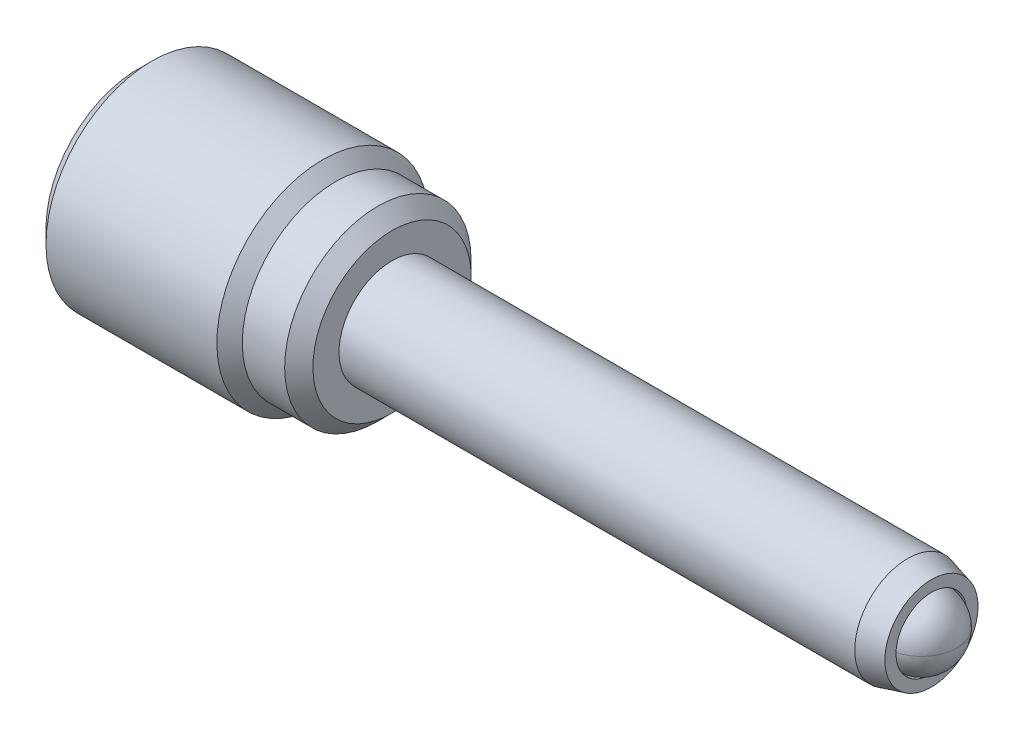
ISO-10303-21;
HEADER;
FILE_DESCRIPTION(('STEP AP214'),'2;1');
FILE_NAME('part.step','',(''),(''),'','','');
FILE_SCHEMA(('AUTOMOTIVE_DESIGN { 1 0 10303 214 1 1 1 1 }'));
ENDSEC;
DATA;
#1=APPLICATION_CONTEXT('core data for automotive mechanical design processes');
#2=APPLICATION_PROTOCOL_DEFINITION('international standard','automotive_design',2000,#1);
#3=PRODUCT_CONTEXT('',#1,'mechanical');
#4=PRODUCT('Part','Part','',(#3));
#5=PRODUCT_RELATED_PRODUCT_CATEGORY('part','',(#4));
#6=PRODUCT_DEFINITION_FORMATION('','',#4);
#7=PRODUCT_DEFINITION_CONTEXT('part definition',#1,'design');
#8=PRODUCT_DEFINITION('design','',#6,#7);
#9=PRODUCT_DEFINITION_SHAPE('','',#8);
#10=(LENGTH_UNIT() NAMED_UNIT(*) SI_UNIT(.MILLI.,.METRE.));
#11=(NAMED_UNIT(*) PLANE_ANGLE_UNIT() SI_UNIT($,.RADIAN.));
#12=(NAMED_UNIT(*) SI_UNIT($,.STERADIAN.) SOLID_ANGLE_UNIT());
#13=UNCERTAINTY_MEASURE_WITH_UNIT(LENGTH_MEASURE(1.E-05),#10,'distance_accuracy_value','');
#14=(GEOMETRIC_REPRESENTATION_CONTEXT(3) GLOBAL_UNCERTAINTY_ASSIGNED_CONTEXT((#13)) GLOBAL_UNIT_ASSIGNED_CONTEXT((#10,
#11,#12)) REPRESENTATION_CONTEXT('',''));
#15=CARTESIAN_POINT('',(0.,0.,0.));
#16=DIRECTION('',(0.,0.,1.));
#17=DIRECTION('',(1.,0.,0.));
#18=AXIS2_PLACEMENT_3D('',#15,#16,#17);
#19=CARTESIAN_POINT('',(-20.193,0.,0.));
#20=DIRECTION('',(-1.,0.,0.));
#21=DIRECTION('',(0.,-1.,0.));
#22=AXIS2_PLACEMENT_3D('',#19,#20,#21);
#23=PLANE('',#22);
#24=CARTESIAN_POINT('',(-20.193,0.,0.));
#25=DIRECTION('',(-1.,0.,0.));
#26=DIRECTION('',(0.,-1.,0.));
#27=AXIS2_PLACEMENT_3D('',#24,#25,#26);
#28=CIRCLE('',#27,4.12749999999999);
#29=CARTESIAN_POINT('',(-20.193,-4.1275,0.));
#30=VERTEX_POINT('',#29);
#31=EDGE_CURVE('P0_E26',#30,#30,#28,.T.);
#32=ORIENTED_EDGE('',*,*,#31,.T.);
#33=EDGE_LOOP('',(#32));
#34=FACE_BOUND('',#33,.T.);
#35=CARTESIAN_POINT('',(-20.193,0.,-2.54));
#36=DIRECTION('',(-1.,0.,0.));
#37=DIRECTION('',(0.,-1.,0.));
#38=AXIS2_PLACEMENT_3D('',#35,#36,#37);
#39=CIRCLE('',#38,1.143);
#40=CARTESIAN_POINT('',(-20.193,-1.143,-2.54));
#41=VERTEX_POINT('',#40);
#42=EDGE_CURVE('P0_E54',#41,#41,#39,.T.);
#43=ORIENTED_EDGE('',*,*,#42,.F.);
#44=EDGE_LOOP('',(#43));
#45=FACE_BOUND('',#44,.T.);
#46=ADVANCED_FACE('P0_F15',(#34,#45),#23,.T.);
#47=CARTESIAN_POINT('',(-8.763,0.,0.));
#48=DIRECTION('',(1.,0.,0.));
#49=DIRECTION('',(0.,1.,0.));
#50=AXIS2_PLACEMENT_3D('',#47,#48,#49);
#51=CYLINDRICAL_SURFACE('',#50,4.7625);
#52=CARTESIAN_POINT('',(-19.558,0.,0.));
#53=DIRECTION('',(-1.,0.,0.));
#54=DIRECTION('',(0.,-1.,0.));
#55=AXIS2_PLACEMENT_3D('',#52,#53,#54);
#56=CIRCLE('',#55,4.7625);
#57=CARTESIAN_POINT('',(-19.558,-4.7625,0.));
#58=VERTEX_POINT('',#57);
#59=EDGE_CURVE('P0_E30',#58,#58,#56,.F.);
#60=ORIENTED_EDGE('',*,*,#59,.T.);
#61=EDGE_LOOP('',(#60));
#62=FACE_BOUND('',#61,.T.);
#63=CARTESIAN_POINT('',(-11.8745,0.,0.));
#64=DIRECTION('',(1.,0.,0.));
#65=DIRECTION('',(0.,1.,0.));
#66=AXIS2_PLACEMENT_3D('',#63,#64,#65);
#67=CIRCLE('',#66,4.7625);
#68=CARTESIAN_POINT('',(-11.8745,4.76249999999999,0.));
#69=VERTEX_POINT('',#68);
#70=EDGE_CURVE('P0_E35',#69,#69,#67,.T.);
#71=ORIENTED_EDGE('',*,*,#70,.F.);
#72=EDGE_LOOP('',(#71));
#73=FACE_BOUND('',#72,.T.);
#74=ADVANCED_FACE('P0_F70',(#62,#73),#51,.T.);
#75=CARTESIAN_POINT('',(-11.303,0.,0.));
#76=DIRECTION('',(-1.,0.,0.));
#77=DIRECTION('',(0.,-1.,0.));
#78=AXIS2_PLACEMENT_3D('',#75,#76,#77);
#79=CONICAL_SURFACE('',#78,4.191,0.785398163397443);
#80=ORIENTED_EDGE('',*,*,#70,.T.);
#81=EDGE_LOOP('',(#80));
#82=FACE_BOUND('',#81,.T.);
#83=CARTESIAN_POINT('',(-11.303,0.,0.));
#84=DIRECTION('',(1.,0.,0.));
#85=DIRECTION('',(0.,1.,0.));
#86=AXIS2_PLACEMENT_3D('',#83,#84,#85);
#87=CIRCLE('',#86,4.191);
#88=CARTESIAN_POINT('',(-11.303,4.191,0.));
#89=VERTEX_POINT('',#88);
#90=EDGE_CURVE('P0_E38',#89,#89,#87,.T.);
#91=ORIENTED_EDGE('',*,*,#90,.F.);
#92=EDGE_LOOP('',(#91));
#93=FACE_BOUND('',#92,.T.);
#94=ADVANCED_FACE('P0_F77',(#82,#93),#79,.T.);
#95=CARTESIAN_POINT('',(-8.763,0.,0.));
#96=DIRECTION('',(1.,0.,0.));
#97=DIRECTION('',(0.,1.,0.));
#98=AXIS2_PLACEMENT_3D('',#95,#96,#97);
#99=CYLINDRICAL_SURFACE('',#98,4.191);
#100=CARTESIAN_POINT('',(-9.398,0.,0.));
#101=DIRECTION('',(1.,0.,0.));
#102=DIRECTION('',(0.,1.,0.));
#103=AXIS2_PLACEMENT_3D('',#100,#101,#102);
#104=CIRCLE('',#103,4.191);
#105=CARTESIAN_POINT('',(-9.398,4.191,0.));
#106=VERTEX_POINT('',#105);
#107=EDGE_CURVE('P0_E10',#106,#106,#104,.F.);
#108=ORIENTED_EDGE('',*,*,#107,.T.);
#109=EDGE_LOOP('',(#108));
#110=FACE_BOUND('',#109,.T.);
#111=ORIENTED_EDGE('',*,*,#90,.T.);
#112=EDGE_LOOP('',(#111));
#113=FACE_BOUND('',#112,.T.);
#114=ADVANCED_FACE('P0_F98',(#110,#113),#99,.T.);
#115=CARTESIAN_POINT('',(-8.763,4.191,0.));
#116=DIRECTION('',(1.,0.,0.));
#117=DIRECTION('',(0.,1.,0.));
#118=AXIS2_PLACEMENT_3D('',#115,#116,#117);
#119=PLANE('',#118);
#120=CARTESIAN_POINT('',(-8.763,0.,0.));
#121=DIRECTION('',(1.,0.,0.));
#122=DIRECTION('',(0.,1.,0.));
#123=AXIS2_PLACEMENT_3D('',#120,#121,#122);
#124=CIRCLE('',#123,3.556);
#125=CARTESIAN_POINT('',(-8.763,3.556,0.));
#126=VERTEX_POINT('',#125);
#127=EDGE_CURVE('P0_E22',#126,#126,#124,.T.);
#128=ORIENTED_EDGE('',*,*,#127,.T.);
#129=EDGE_LOOP('',(#128));
#130=FACE_BOUND('',#129,.T.);
#131=CARTESIAN_POINT('',(-8.763,0.,0.));
#132=DIRECTION('',(1.,0.,0.));
#133=DIRECTION('',(0.,1.,0.));
#134=AXIS2_PLACEMENT_3D('',#131,#132,#133);
#135=CIRCLE('',#134,2.3622);
#136=CARTESIAN_POINT('',(-8.763,2.36219999999999,0.));
#137=VERTEX_POINT('',#136);
#138=EDGE_CURVE('P0_E45',#137,#137,#135,.T.);
#139=ORIENTED_EDGE('',*,*,#138,.F.);
#140=EDGE_LOOP('',(#139));
#141=FACE_BOUND('',#140,.T.);
#142=ADVANCED_FACE('P0_F102',(#130,#141),#119,.T.);
#143=CARTESIAN_POINT('',(-11.049,0.,0.));
#144=DIRECTION('',(1.,0.,0.));
#145=DIRECTION('',(0.,1.,0.));
#146=AXIS2_PLACEMENT_3D('',#143,#144,#145);
#147=CYLINDRICAL_SURFACE('',#146,2.3622);
#148=CARTESIAN_POINT('',(-11.049,0.,0.));
#149=DIRECTION('',(1.,0.,0.));
#150=DIRECTION('',(0.,1.,0.));
#151=AXIS2_PLACEMENT_3D('',#148,#149,#150);
#152=CIRCLE('',#151,2.3622);
#153=CARTESIAN_POINT('',(-11.049,2.3622,0.));
#154=VERTEX_POINT('',#153);
#155=EDGE_CURVE('P0_E44',#154,#154,#152,.T.);
#156=ORIENTED_EDGE('',*,*,#155,.F.);
#157=EDGE_LOOP('',(#156));
#158=FACE_BOUND('',#157,.T.);
#159=ORIENTED_EDGE('',*,*,#138,.T.);
#160=EDGE_LOOP('',(#159));
#161=FACE_BOUND('',#160,.T.);
#162=ADVANCED_FACE('P0_F107',(#158,#161),#147,.F.);
#163=CARTESIAN_POINT('',(-11.049,0.,0.));
#164=DIRECTION('',(1.,0.,0.));
#165=DIRECTION('',(0.,1.,0.));
#166=AXIS2_PLACEMENT_3D('',#163,#164,#165);
#167=PLANE('',#166);
#168=CARTESIAN_POINT('',(-11.049,0.,0.));
#169=DIRECTION('',(1.,0.,0.));
#170=DIRECTION('',(0.,1.,0.));
#171=AXIS2_PLACEMENT_3D('',#168,#169,#170);
#172=CIRCLE('',#171,2.286);
#173=CARTESIAN_POINT('',(-11.049,2.286,0.));
#174=VERTEX_POINT('',#173);
#175=EDGE_CURVE('P0_E48',#174,#174,#172,.T.);
#176=ORIENTED_EDGE('',*,*,#175,.F.);
#177=EDGE_LOOP('',(#176));
#178=FACE_BOUND('',#177,.T.);
#179=ORIENTED_EDGE('',*,*,#155,.T.);
#180=EDGE_LOOP('',(#179));
#181=FACE_BOUND('',#180,.T.);
#182=ADVANCED_FACE('P0_F116',(#178,#181),#167,.T.);
#183=CARTESIAN_POINT('',(-16.637,0.,-9.36162135623731));
#184=DIRECTION('',(1.,0.,0.));
#185=DIRECTION('',(0.,1.,0.));
#186=AXIS2_PLACEMENT_3D('',#183,#184,#185);
#187=PLANE('',#186);
#188=CARTESIAN_POINT('',(-16.637,0.,0.));
#189=DIRECTION('',(1.,0.,0.));
#190=DIRECTION('',(0.,1.,0.));
#191=AXIS2_PLACEMENT_3D('',#188,#189,#190);
#192=CIRCLE('',#191,2.286);
#193=CARTESIAN_POINT('',(-16.637,2.286,0.));
#194=VERTEX_POINT('',#193);
#195=EDGE_CURVE('P0_E41',#194,#194,#192,.T.);
#196=ORIENTED_EDGE('',*,*,#195,.T.);
#197=EDGE_LOOP('',(#196));
#198=FACE_BOUND('',#197,.T.);
#199=ADVANCED_FACE('P0_F112',(#198),#187,.T.);
#200=CARTESIAN_POINT('',(-16.637,0.,0.));
#201=DIRECTION('',(1.,0.,0.));
#202=DIRECTION('',(0.,1.,0.));
#203=AXIS2_PLACEMENT_3D('',#200,#201,#202);
#204=CYLINDRICAL_SURFACE('',#203,2.286);
#205=ORIENTED_EDGE('',*,*,#195,.F.);
#206=EDGE_LOOP('',(#205));
#207=FACE_BOUND('',#206,.T.);
#208=ORIENTED_EDGE('',*,*,#175,.T.);
#209=EDGE_LOOP('',(#208));
#210=FACE_BOUND('',#209,.T.);
#211=ADVANCED_FACE('P0_F65',(#207,#210),#204,.F.);
#212=CARTESIAN_POINT('',(-17.907,0.,-2.54));
#213=DIRECTION('',(-1.,0.,0.));
#214=DIRECTION('',(0.,-1.,0.));
#215=AXIS2_PLACEMENT_3D('',#212,#213,#214);
#216=CYLINDRICAL_SURFACE('',#215,1.143);
#217=CARTESIAN_POINT('',(-17.907,0.,-2.54));
#218=DIRECTION('',(-1.,0.,0.));
#219=DIRECTION('',(0.,-1.,0.));
#220=AXIS2_PLACEMENT_3D('',#217,#218,#219);
#221=CIRCLE('',#220,1.143);
#222=CARTESIAN_POINT('',(-17.907,-1.143,-2.54));
#223=VERTEX_POINT('',#222);
#224=EDGE_CURVE('P0_E53',#223,#223,#221,.T.);
#225=ORIENTED_EDGE('',*,*,#224,.F.);
#226=EDGE_LOOP('',(#225));
#227=FACE_BOUND('',#226,.T.);
#228=ORIENTED_EDGE('',*,*,#42,.T.);
#229=EDGE_LOOP('',(#228));
#230=FACE_BOUND('',#229,.T.);
#231=ADVANCED_FACE('P0_F62',(#227,#230),#216,.F.);
#232=CARTESIAN_POINT('',(-17.907,0.,-2.54));
#233=DIRECTION('',(-1.,0.,0.));
#234=DIRECTION('',(0.,-1.,0.));
#235=AXIS2_PLACEMENT_3D('',#232,#233,#234);
#236=PLANE('',#235);
#237=ORIENTED_EDGE('',*,*,#224,.T.);
#238=EDGE_LOOP('',(#237));
#239=FACE_BOUND('',#238,.T.);
#240=ADVANCED_FACE('P0_F60',(#239),#236,.T.);
#241=CARTESIAN_POINT('',(-19.558,0.,0.));
#242=DIRECTION('',(1.,0.,0.));
#243=DIRECTION('',(0.,1.,0.));
#244=AXIS2_PLACEMENT_3D('',#241,#242,#243);
#245=CONICAL_SURFACE('',#244,4.7625,0.78539816339745);
#246=ORIENTED_EDGE('',*,*,#31,.F.);
#247=EDGE_LOOP('',(#246));
#248=FACE_BOUND('',#247,.T.);
#249=ORIENTED_EDGE('',*,*,#59,.F.);
#250=EDGE_LOOP('',(#249));
#251=FACE_BOUND('',#250,.T.);
#252=ADVANCED_FACE('P0_F81',(#248,#251),#245,.T.);
#253=CARTESIAN_POINT('',(-8.763,0.,0.));
#254=DIRECTION('',(-1.,0.,0.));
#255=DIRECTION('',(0.,-1.,0.));
#256=AXIS2_PLACEMENT_3D('',#253,#254,#255);
#257=CONICAL_SURFACE('',#256,3.556,0.785398163397447);
#258=ORIENTED_EDGE('',*,*,#107,.F.);
#259=EDGE_LOOP('',(#258));
#260=FACE_BOUND('',#259,.T.);
#261=ORIENTED_EDGE('',*,*,#127,.F.);
#262=EDGE_LOOP('',(#261));
#263=FACE_BOUND('',#262,.T.);
#264=ADVANCED_FACE('P0_F17',(#260,#263),#257,.T.);
#265=CLOSED_SHELL('',(#46,#74,#94,#114,#142,#162,#182,#199,#211,#231,#240,#252,#264));
#266=MANIFOLD_SOLID_BREP('P0_B1',#265);
#267=CARTESIAN_POINT('',(-19.002375,-0.00653754846686644,-2.58717415696166));
#268=DIRECTION('',(0.,0.,1.));
#269=DIRECTION('',(0.,1.,0.));
#270=AXIS2_PLACEMENT_3D('',#267,#268,#269);
#271=SPHERICAL_SURFACE('',#270,1.190625);
#272=CARTESIAN_POINT('',(-19.002375,-0.00653754846686666,-1.39654915696166));
#273=VERTEX_POINT('',#272);
#274=VERTEX_LOOP('',#273);
#275=FACE_BOUND('',#274,.T.);
#276=ADVANCED_FACE('P1_F13',(#275),#271,.T.);
#277=CLOSED_SHELL('',(#276));
#278=MANIFOLD_SOLID_BREP('P1_B1',#277);
#279=CARTESIAN_POINT('',(15.0495,0.,0.));
#280=DIRECTION('',(0.,0.,-1.));
#281=DIRECTION('',(0.,-1.,0.));
#282=AXIS2_PLACEMENT_3D('',#279,#280,#281);
#283=SPHERICAL_SURFACE('',#282,1.5875);
#284=CARTESIAN_POINT('',(15.0495,0.,0.));
#285=DIRECTION('',(-1.,0.,0.));
#286=DIRECTION('',(0.,-1.,0.));
#287=AXIS2_PLACEMENT_3D('',#284,#285,#286);
#288=CIRCLE('',#287,1.5875);
#289=CARTESIAN_POINT('',(15.0495,0.,1.5875));
#290=VERTEX_POINT('',#289);
#291=CARTESIAN_POINT('',(15.0495,0.,-1.5875));
#292=VERTEX_POINT('',#291);
#293=EDGE_CURVE('P2_E37',#290,#292,#288,.T.);
#294=ORIENTED_EDGE('',*,*,#293,.F.);
#295=CARTESIAN_POINT('',(15.0495,0.,0.));
#296=DIRECTION('',(0.,1.,0.));
#297=DIRECTION('',(-1.,0.,0.));
#298=AXIS2_PLACEMENT_3D('',#295,#296,#297);
#299=CIRCLE('',#298,1.5875);
#300=EDGE_CURVE('P2_E10',#290,#292,#299,.T.);
#301=ORIENTED_EDGE('',*,*,#300,.T.);
#302=EDGE_LOOP('',(#294,#301));
#303=FACE_BOUND('',#302,.T.);
#304=ADVANCED_FACE('P2_F16',(#303),#283,.T.);
#305=ORIENTED_EDGE('',*,*,#293,.T.);
#306=CARTESIAN_POINT('',(15.0495,0.,0.));
#307=DIRECTION('',(0.,1.,0.));
#308=DIRECTION('',(-1.,0.,0.));
#309=AXIS2_PLACEMENT_3D('',#306,#307,#308);
#310=CIRCLE('',#309,1.5875);
#311=EDGE_CURVE('P2_E23',#292,#290,#310,.T.);
#312=ORIENTED_EDGE('',*,*,#311,.T.);
#313=EDGE_LOOP('',(#305,#312));
#314=FACE_BOUND('',#313,.T.);
#315=ADVANCED_FACE('P2_F36',(#314),#283,.T.);
#316=ORIENTED_EDGE('',*,*,#311,.F.);
#317=EDGE_CURVE('P2_E33',#292,#290,#288,.T.);
#318=ORIENTED_EDGE('',*,*,#317,.T.);
#319=EDGE_LOOP('',(#316,#318));
#320=FACE_BOUND('',#319,.T.);
#321=ADVANCED_FACE('P2_F39',(#320),#283,.T.);
#322=ORIENTED_EDGE('',*,*,#300,.F.);
#323=ORIENTED_EDGE('',*,*,#317,.F.);
#324=EDGE_LOOP('',(#322,#323));
#325=FACE_BOUND('',#324,.T.);
#326=ADVANCED_FACE('P2_F18',(#325),#283,.T.);
#327=CLOSED_SHELL('',(#304,#315,#321,#326));
#328=MANIFOLD_SOLID_BREP('P2_B1',#327);
#329=CARTESIAN_POINT('',(-16.637,0.,0.));
#330=DIRECTION('',(-1.,0.,0.));
#331=DIRECTION('',(0.,-1.,0.));
#332=AXIS2_PLACEMENT_3D('',#329,#330,#331);
#333=PLANE('',#332);
#334=CARTESIAN_POINT('',(-16.637,0.,0.));
#335=DIRECTION('',(1.,0.,0.));
#336=DIRECTION('',(0.,1.,0.));
#337=AXIS2_PLACEMENT_3D('',#334,#335,#336);
#338=CIRCLE('',#337,2.12725);
#339=CARTESIAN_POINT('',(-16.637,2.12725,0.));
#340=VERTEX_POINT('',#339);
#341=EDGE_CURVE('P3_E11',#340,#340,#338,.T.);
#342=ORIENTED_EDGE('',*,*,#341,.F.);
#343=EDGE_LOOP('',(#342));
#344=FACE_BOUND('',#343,.T.);
#345=ADVANCED_FACE('P3_F17',(#344),#333,.T.);
#346=CARTESIAN_POINT('',(-16.383,0.,0.));
#347=DIRECTION('',(1.,0.,0.));
#348=DIRECTION('',(0.,1.,0.));
#349=AXIS2_PLACEMENT_3D('',#346,#347,#348);
#350=CONICAL_SURFACE('',#349,2.38125,0.785398163397453);
#351=ORIENTED_EDGE('',*,*,#341,.T.);
#352=EDGE_LOOP('',(#351));
#353=FACE_BOUND('',#352,.T.);
#354=CARTESIAN_POINT('',(-16.383,0.,0.));
#355=DIRECTION('',(1.,0.,0.));
#356=DIRECTION('',(0.,1.,0.));
#357=AXIS2_PLACEMENT_3D('',#354,#355,#356);
#358=CIRCLE('',#357,2.38125);
#359=CARTESIAN_POINT('',(-16.383,2.38125,0.));
#360=VERTEX_POINT('',#359);
#361=EDGE_CURVE('P3_E23',#360,#360,#358,.T.);
#362=ORIENTED_EDGE('',*,*,#361,.F.);
#363=EDGE_LOOP('',(#362));
#364=FACE_BOUND('',#363,.T.);
#365=ADVANCED_FACE('P3_F41',(#353,#364),#350,.T.);
#366=CARTESIAN_POINT('',(12.8044359697327,0.,0.));
#367=DIRECTION('',(1.,0.,0.));
#368=DIRECTION('',(0.,1.,0.));
#369=AXIS2_PLACEMENT_3D('',#366,#367,#368);
#370=CYLINDRICAL_SURFACE('',#369,2.38125);
#371=ORIENTED_EDGE('',*,*,#361,.T.);
#372=EDGE_LOOP('',(#371));
#373=FACE_BOUND('',#372,.T.);
#374=CARTESIAN_POINT('',(14.4275664817372,0.,0.));
#375=DIRECTION('',(1.,0.,0.));
#376=DIRECTION('',(0.,1.,0.));
#377=AXIS2_PLACEMENT_3D('',#374,#375,#376);
#378=CIRCLE('',#377,2.38125);
#379=CARTESIAN_POINT('',(14.4275664817372,2.38125,0.));
#380=VERTEX_POINT('',#379);
#381=EDGE_CURVE('P3_E54',#380,#380,#378,.T.);
#382=ORIENTED_EDGE('',*,*,#381,.F.);
#383=EDGE_LOOP('',(#382));
#384=FACE_BOUND('',#383,.T.);
#385=ADVANCED_FACE('P3_F47',(#373,#384),#370,.T.);
#386=CARTESIAN_POINT('',(15.494,0.,0.));
#387=DIRECTION('',(-1.,0.,0.));
#388=DIRECTION('',(0.,-1.,0.));
#389=AXIS2_PLACEMENT_3D('',#386,#387,#388);
#390=CONICAL_SURFACE('',#389,2.0955,0.26179938779915);
#391=ORIENTED_EDGE('',*,*,#381,.T.);
#392=EDGE_LOOP('',(#391));
#393=FACE_BOUND('',#392,.T.);
#394=CARTESIAN_POINT('',(15.494,0.,0.));
#395=DIRECTION('',(1.,0.,0.));
#396=DIRECTION('',(0.,1.,0.));
#397=AXIS2_PLACEMENT_3D('',#394,#395,#396);
#398=CIRCLE('',#397,2.0955);
#399=CARTESIAN_POINT('',(15.494,2.0955,0.));
#400=VERTEX_POINT('',#399);
#401=EDGE_CURVE('P3_E56',#400,#400,#398,.T.);
#402=ORIENTED_EDGE('',*,*,#401,.F.);
#403=EDGE_LOOP('',(#402));
#404=FACE_BOUND('',#403,.T.);
#405=ADVANCED_FACE('P3_F70',(#393,#404),#390,.T.);
#406=CARTESIAN_POINT('',(15.494,2.0955,0.));
#407=DIRECTION('',(1.,0.,0.));
#408=DIRECTION('',(0.,1.,0.));
#409=AXIS2_PLACEMENT_3D('',#406,#407,#408);
#410=PLANE('',#409);
#411=ORIENTED_EDGE('',*,*,#401,.T.);
#412=EDGE_LOOP('',(#411));
#413=FACE_BOUND('',#412,.T.);
#414=CARTESIAN_POINT('',(15.494,0.,0.));
#415=DIRECTION('',(1.,0.,0.));
#416=DIRECTION('',(0.,1.,0.));
#417=AXIS2_PLACEMENT_3D('',#414,#415,#416);
#418=CIRCLE('',#417,1.59385);
#419=CARTESIAN_POINT('',(15.494,1.59385,0.));
#420=VERTEX_POINT('',#419);
#421=EDGE_CURVE('P3_E61',#420,#420,#418,.T.);
#422=ORIENTED_EDGE('',*,*,#421,.F.);
#423=EDGE_LOOP('',(#422));
#424=FACE_BOUND('',#423,.T.);
#425=ADVANCED_FACE('P3_F36',(#413,#424),#410,.T.);
#426=CARTESIAN_POINT('',(12.8044359697327,0.,0.));
#427=DIRECTION('',(1.,0.,0.));
#428=DIRECTION('',(0.,1.,0.));
#429=AXIS2_PLACEMENT_3D('',#426,#427,#428);
#430=CYLINDRICAL_SURFACE('',#429,1.59385);
#431=ORIENTED_EDGE('',*,*,#421,.T.);
#432=EDGE_LOOP('',(#431));
#433=FACE_BOUND('',#432,.T.);
#434=CARTESIAN_POINT('',(14.3982859697327,0.,0.));
#435=DIRECTION('',(1.,0.,0.));
#436=DIRECTION('',(0.,1.,0.));
#437=AXIS2_PLACEMENT_3D('',#434,#435,#436);
#438=CIRCLE('',#437,1.59385);
#439=CARTESIAN_POINT('',(14.3982859697327,1.59385,0.));
#440=VERTEX_POINT('',#439);
#441=EDGE_CURVE('P3_E64',#440,#440,#438,.T.);
#442=ORIENTED_EDGE('',*,*,#441,.F.);
#443=EDGE_LOOP('',(#442));
#444=FACE_BOUND('',#443,.T.);
#445=ADVANCED_FACE('P3_F28',(#433,#444),#430,.F.);
#446=CARTESIAN_POINT('',(12.8044359697327,0.,0.));
#447=DIRECTION('',(1.,0.,0.));
#448=DIRECTION('',(0.,1.,0.));
#449=AXIS2_PLACEMENT_3D('',#446,#447,#448);
#450=CONICAL_SURFACE('',#449,0.,0.78539816339745);
#451=ORIENTED_EDGE('',*,*,#441,.T.);
#452=EDGE_LOOP('',(#451));
#453=FACE_BOUND('',#452,.T.);
#454=CARTESIAN_POINT('',(12.8044359697327,0.,0.));
#455=VERTEX_POINT('',#454);
#456=VERTEX_LOOP('',#455);
#457=FACE_BOUND('',#456,.T.);
#458=ADVANCED_FACE('P3_F26',(#453,#457),#450,.F.);
#459=CLOSED_SHELL('',(#345,#365,#385,#405,#425,#445,#458));
#460=MANIFOLD_SOLID_BREP('P3_B1',#459);
#461=ADVANCED_BREP_SHAPE_REPRESENTATION('',(#18,#266,#278,#328,#460),#14);
#462=SHAPE_DEFINITION_REPRESENTATION(#9,#461);
ENDSEC;
END-ISO-10303-21;
